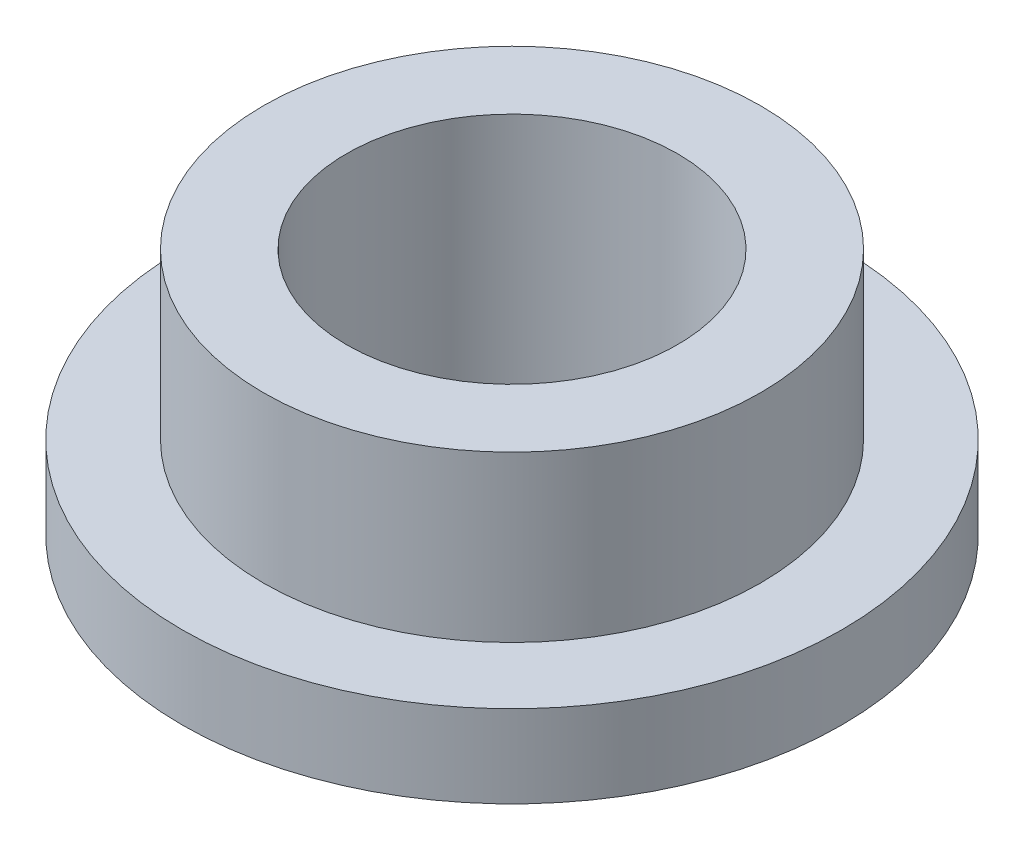
ISO-10303-21;
HEADER;
FILE_DESCRIPTION(('STEP AP214'),'2;1');
FILE_NAME('part.step','',(''),(''),'','','');
FILE_SCHEMA(('AUTOMOTIVE_DESIGN { 1 0 10303 214 1 1 1 1 }'));
ENDSEC;
DATA;
#1=APPLICATION_CONTEXT('core data for automotive mechanical design processes');
#2=APPLICATION_PROTOCOL_DEFINITION('international standard','automotive_design',2000,#1);
#3=PRODUCT_CONTEXT('',#1,'mechanical');
#4=PRODUCT('Part','Part','',(#3));
#5=PRODUCT_RELATED_PRODUCT_CATEGORY('part','',(#4));
#6=PRODUCT_DEFINITION_FORMATION('','',#4);
#7=PRODUCT_DEFINITION_CONTEXT('part definition',#1,'design');
#8=PRODUCT_DEFINITION('design','',#6,#7);
#9=PRODUCT_DEFINITION_SHAPE('','',#8);
#10=(LENGTH_UNIT() NAMED_UNIT(*) SI_UNIT(.MILLI.,.METRE.));
#11=(NAMED_UNIT(*) PLANE_ANGLE_UNIT() SI_UNIT($,.RADIAN.));
#12=(NAMED_UNIT(*) SI_UNIT($,.STERADIAN.) SOLID_ANGLE_UNIT());
#13=UNCERTAINTY_MEASURE_WITH_UNIT(LENGTH_MEASURE(1.E-05),#10,'distance_accuracy_value','');
#14=(GEOMETRIC_REPRESENTATION_CONTEXT(3) GLOBAL_UNCERTAINTY_ASSIGNED_CONTEXT((#13)) GLOBAL_UNIT_ASSIGNED_CONTEXT((#10,
#11,#12)) REPRESENTATION_CONTEXT('',''));
#15=CARTESIAN_POINT('',(0.,0.,0.));
#16=DIRECTION('',(0.,0.,1.));
#17=DIRECTION('',(1.,0.,0.));
#18=AXIS2_PLACEMENT_3D('',#15,#16,#17);
#19=CARTESIAN_POINT('',(0.,4.7625,0.));
#20=DIRECTION('',(0.,1.,0.));
#21=DIRECTION('',(0.,0.,1.));
#22=AXIS2_PLACEMENT_3D('',#19,#20,#21);
#23=PLANE('',#22);
#24=CARTESIAN_POINT('',(0.,4.7625,0.));
#25=DIRECTION('',(0.,1.,0.));
#26=DIRECTION('',(0.,0.,1.));
#27=AXIS2_PLACEMENT_3D('',#24,#25,#26);
#28=CIRCLE('',#27,4.7879);
#29=CARTESIAN_POINT('',(0.,4.7625,4.7879));
#30=VERTEX_POINT('',#29);
#31=EDGE_CURVE('E10',#30,#30,#28,.T.);
#32=ORIENTED_EDGE('',*,*,#31,.T.);
#33=EDGE_LOOP('',(#32));
#34=FACE_BOUND('',#33,.T.);
#35=CARTESIAN_POINT('',(0.,4.7625,0.));
#36=DIRECTION('',(0.,1.,0.));
#37=DIRECTION('',(0.,0.,1.));
#38=AXIS2_PLACEMENT_3D('',#35,#36,#37);
#39=CIRCLE('',#38,3.1877);
#40=CARTESIAN_POINT('',(0.,4.7625,3.1877));
#41=VERTEX_POINT('',#40);
#42=EDGE_CURVE('E42',#41,#41,#39,.T.);
#43=ORIENTED_EDGE('',*,*,#42,.F.);
#44=EDGE_LOOP('',(#43));
#45=FACE_BOUND('',#44,.T.);
#46=ADVANCED_FACE('F35',(#34,#45),#23,.T.);
#47=CARTESIAN_POINT('',(0.,0.,0.));
#48=DIRECTION('',(0.,1.,0.));
#49=DIRECTION('',(0.,0.,1.));
#50=AXIS2_PLACEMENT_3D('',#47,#48,#49);
#51=PLANE('',#50);
#52=CARTESIAN_POINT('',(0.,0.,0.));
#53=DIRECTION('',(0.,1.,0.));
#54=DIRECTION('',(0.,0.,1.));
#55=AXIS2_PLACEMENT_3D('',#52,#53,#54);
#56=CIRCLE('',#55,3.1877);
#57=CARTESIAN_POINT('',(0.,0.,3.1877));
#58=VERTEX_POINT('',#57);
#59=EDGE_CURVE('E46',#58,#58,#56,.T.);
#60=ORIENTED_EDGE('',*,*,#59,.T.);
#61=EDGE_LOOP('',(#60));
#62=FACE_BOUND('',#61,.T.);
#63=CARTESIAN_POINT('',(0.,0.,0.));
#64=DIRECTION('',(0.,1.,0.));
#65=DIRECTION('',(0.,0.,1.));
#66=AXIS2_PLACEMENT_3D('',#63,#64,#65);
#67=CIRCLE('',#66,6.35);
#68=CARTESIAN_POINT('',(0.,0.,6.35));
#69=VERTEX_POINT('',#68);
#70=EDGE_CURVE('E53',#69,#69,#67,.T.);
#71=ORIENTED_EDGE('',*,*,#70,.F.);
#72=EDGE_LOOP('',(#71));
#73=FACE_BOUND('',#72,.T.);
#74=ADVANCED_FACE('F78',(#62,#73),#51,.F.);
#75=CARTESIAN_POINT('',(0.,4.7625,0.));
#76=DIRECTION('',(0.,-1.,0.));
#77=DIRECTION('',(0.,0.,-1.));
#78=AXIS2_PLACEMENT_3D('',#75,#76,#77);
#79=CYLINDRICAL_SURFACE('',#78,4.7879);
#80=CARTESIAN_POINT('',(0.,1.5875,0.));
#81=DIRECTION('',(0.,1.,0.));
#82=DIRECTION('',(0.,0.,1.));
#83=AXIS2_PLACEMENT_3D('',#80,#81,#82);
#84=CIRCLE('',#83,4.7879);
#85=CARTESIAN_POINT('',(0.,1.5875,4.7879));
#86=VERTEX_POINT('',#85);
#87=EDGE_CURVE('E56',#86,#86,#84,.T.);
#88=ORIENTED_EDGE('',*,*,#87,.T.);
#89=EDGE_LOOP('',(#88));
#90=FACE_BOUND('',#89,.T.);
#91=ORIENTED_EDGE('',*,*,#31,.F.);
#92=EDGE_LOOP('',(#91));
#93=FACE_BOUND('',#92,.T.);
#94=ADVANCED_FACE('F37',(#90,#93),#79,.T.);
#95=CARTESIAN_POINT('',(0.,4.7625,0.));
#96=DIRECTION('',(0.,-1.,0.));
#97=DIRECTION('',(0.,0.,-1.));
#98=AXIS2_PLACEMENT_3D('',#95,#96,#97);
#99=CYLINDRICAL_SURFACE('',#98,3.1877);
#100=ORIENTED_EDGE('',*,*,#42,.T.);
#101=EDGE_LOOP('',(#100));
#102=FACE_BOUND('',#101,.T.);
#103=ORIENTED_EDGE('',*,*,#59,.F.);
#104=EDGE_LOOP('',(#103));
#105=FACE_BOUND('',#104,.T.);
#106=ADVANCED_FACE('F67',(#102,#105),#99,.F.);
#107=CARTESIAN_POINT('',(0.,1.5875,0.));
#108=DIRECTION('',(0.,1.,0.));
#109=DIRECTION('',(0.,0.,1.));
#110=AXIS2_PLACEMENT_3D('',#107,#108,#109);
#111=PLANE('',#110);
#112=CARTESIAN_POINT('',(0.,1.5875,0.));
#113=DIRECTION('',(0.,1.,0.));
#114=DIRECTION('',(0.,0.,1.));
#115=AXIS2_PLACEMENT_3D('',#112,#113,#114);
#116=CIRCLE('',#115,6.35);
#117=CARTESIAN_POINT('',(0.,1.5875,6.35));
#118=VERTEX_POINT('',#117);
#119=EDGE_CURVE('E51',#118,#118,#116,.T.);
#120=ORIENTED_EDGE('',*,*,#119,.T.);
#121=EDGE_LOOP('',(#120));
#122=FACE_BOUND('',#121,.T.);
#123=ORIENTED_EDGE('',*,*,#87,.F.);
#124=EDGE_LOOP('',(#123));
#125=FACE_BOUND('',#124,.T.);
#126=ADVANCED_FACE('F64',(#122,#125),#111,.T.);
#127=CARTESIAN_POINT('',(0.,1.5875,0.));
#128=DIRECTION('',(0.,-1.,0.));
#129=DIRECTION('',(0.,0.,-1.));
#130=AXIS2_PLACEMENT_3D('',#127,#128,#129);
#131=CYLINDRICAL_SURFACE('',#130,6.35);
#132=ORIENTED_EDGE('',*,*,#119,.F.);
#133=EDGE_LOOP('',(#132));
#134=FACE_BOUND('',#133,.T.);
#135=ORIENTED_EDGE('',*,*,#70,.T.);
#136=EDGE_LOOP('',(#135));
#137=FACE_BOUND('',#136,.T.);
#138=ADVANCED_FACE('F66',(#134,#137),#131,.T.);
#139=CLOSED_SHELL('',(#46,#74,#94,#106,#126,#138));
#140=MANIFOLD_SOLID_BREP('B2',#139);
#141=ADVANCED_BREP_SHAPE_REPRESENTATION('',(#18,#140),#14);
#142=SHAPE_DEFINITION_REPRESENTATION(#9,#141);
ENDSEC;
END-ISO-10303-21;
